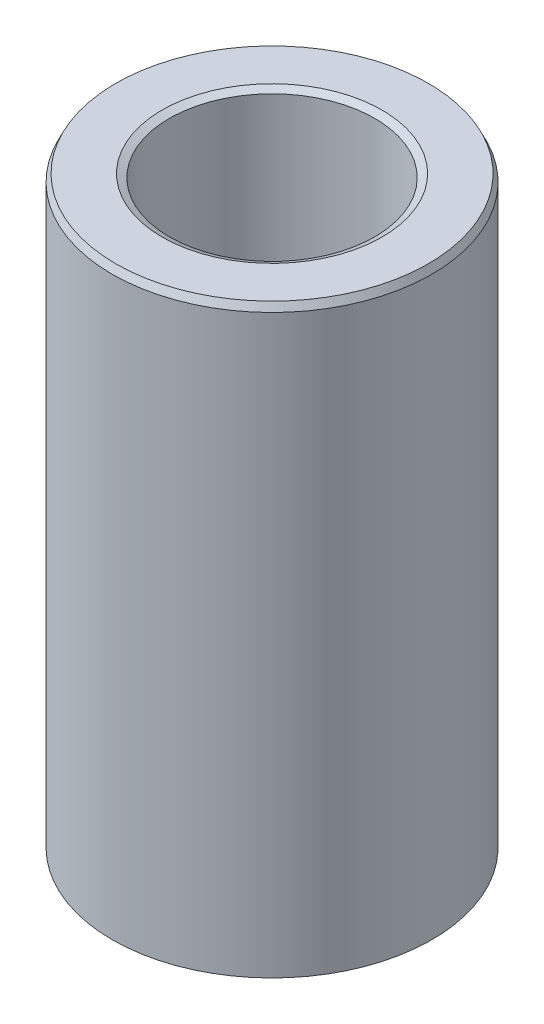
ISO-10303-21;
HEADER;
FILE_DESCRIPTION(('STEP AP214'),'2;1');
FILE_NAME('part.step','',(''),(''),'','','');
FILE_SCHEMA(('AUTOMOTIVE_DESIGN { 1 0 10303 214 1 1 1 1 }'));
ENDSEC;
DATA;
#1=APPLICATION_CONTEXT('core data for automotive mechanical design processes');
#2=APPLICATION_PROTOCOL_DEFINITION('international standard','automotive_design',2000,#1);
#3=PRODUCT_CONTEXT('',#1,'mechanical');
#4=PRODUCT('Part','Part','',(#3));
#5=PRODUCT_RELATED_PRODUCT_CATEGORY('part','',(#4));
#6=PRODUCT_DEFINITION_FORMATION('','',#4);
#7=PRODUCT_DEFINITION_CONTEXT('part definition',#1,'design');
#8=PRODUCT_DEFINITION('design','',#6,#7);
#9=PRODUCT_DEFINITION_SHAPE('','',#8);
#10=(LENGTH_UNIT() NAMED_UNIT(*) SI_UNIT(.MILLI.,.METRE.));
#11=(NAMED_UNIT(*) PLANE_ANGLE_UNIT() SI_UNIT($,.RADIAN.));
#12=(NAMED_UNIT(*) SI_UNIT($,.STERADIAN.) SOLID_ANGLE_UNIT());
#13=UNCERTAINTY_MEASURE_WITH_UNIT(LENGTH_MEASURE(1.E-05),#10,'distance_accuracy_value','');
#14=(GEOMETRIC_REPRESENTATION_CONTEXT(3) GLOBAL_UNCERTAINTY_ASSIGNED_CONTEXT((#13)) GLOBAL_UNIT_ASSIGNED_CONTEXT((#10,
#11,#12)) REPRESENTATION_CONTEXT('',''));
#15=CARTESIAN_POINT('',(0.,0.,0.));
#16=DIRECTION('',(0.,0.,1.));
#17=DIRECTION('',(1.,0.,0.));
#18=AXIS2_PLACEMENT_3D('',#15,#16,#17);
#19=CARTESIAN_POINT('',(0.,192.904847847091,0.));
#20=DIRECTION('',(0.,-1.,0.));
#21=DIRECTION('',(0.,0.,-1.));
#22=AXIS2_PLACEMENT_3D('',#19,#20,#21);
#23=CYLINDRICAL_SURFACE('',#22,52.5);
#24=CARTESIAN_POINT('',(0.,1.15369242430183,0.));
#25=DIRECTION('',(0.,1.,0.));
#26=DIRECTION('',(0.,0.,1.));
#27=AXIS2_PLACEMENT_3D('',#24,#25,#26);
#28=CIRCLE('',#27,52.5);
#29=CARTESIAN_POINT('',(0.,1.15369242430183,52.5));
#30=VERTEX_POINT('',#29);
#31=EDGE_CURVE('E10',#30,#30,#28,.T.);
#32=ORIENTED_EDGE('',*,*,#31,.T.);
#33=EDGE_LOOP('',(#32));
#34=FACE_BOUND('',#33,.T.);
#35=CARTESIAN_POINT('',(0.,190.494336374024,0.));
#36=DIRECTION('',(0.,1.,0.));
#37=DIRECTION('',(0.,0.,1.));
#38=AXIS2_PLACEMENT_3D('',#35,#36,#37);
#39=CIRCLE('',#38,52.5);
#40=CARTESIAN_POINT('',(0.,190.494336374024,52.5));
#41=VERTEX_POINT('',#40);
#42=EDGE_CURVE('E50',#41,#41,#39,.F.);
#43=ORIENTED_EDGE('',*,*,#42,.T.);
#44=EDGE_LOOP('',(#43));
#45=FACE_BOUND('',#44,.T.);
#46=ADVANCED_FACE('F39',(#34,#45),#23,.T.);
#47=CARTESIAN_POINT('',(0.,192.904847847091,0.));
#48=DIRECTION('',(0.,1.,0.));
#49=DIRECTION('',(0.,0.,1.));
#50=AXIS2_PLACEMENT_3D('',#47,#48,#49);
#51=PLANE('',#50);
#52=CARTESIAN_POINT('',(0.,192.904847847091,0.));
#53=DIRECTION('',(0.,1.,0.));
#54=DIRECTION('',(0.,0.,1.));
#55=AXIS2_PLACEMENT_3D('',#52,#53,#54);
#56=CIRCLE('',#55,36.1433432827851);
#57=CARTESIAN_POINT('',(0.,192.904847847091,36.1433432827851));
#58=VERTEX_POINT('',#57);
#59=EDGE_CURVE('E58',#58,#58,#56,.F.);
#60=ORIENTED_EDGE('',*,*,#59,.T.);
#61=EDGE_LOOP('',(#60));
#62=FACE_BOUND('',#61,.T.);
#63=CARTESIAN_POINT('',(0.,192.904847847091,0.));
#64=DIRECTION('',(0.,1.,0.));
#65=DIRECTION('',(0.,0.,1.));
#66=AXIS2_PLACEMENT_3D('',#63,#64,#65);
#67=CIRCLE('',#66,51.3463075756982);
#68=CARTESIAN_POINT('',(0.,192.904847847091,51.3463075756982));
#69=VERTEX_POINT('',#68);
#70=EDGE_CURVE('E61',#69,#69,#67,.T.);
#71=ORIENTED_EDGE('',*,*,#70,.T.);
#72=EDGE_LOOP('',(#71));
#73=FACE_BOUND('',#72,.T.);
#74=ADVANCED_FACE('F88',(#62,#73),#51,.T.);
#75=CARTESIAN_POINT('',(0.,0.,0.));
#76=DIRECTION('',(0.,1.,0.));
#77=DIRECTION('',(0.,0.,1.));
#78=AXIS2_PLACEMENT_3D('',#75,#76,#77);
#79=PLANE('',#78);
#80=CARTESIAN_POINT('',(0.,0.,0.));
#81=DIRECTION('',(0.,1.,0.));
#82=DIRECTION('',(0.,0.,1.));
#83=AXIS2_PLACEMENT_3D('',#80,#81,#82);
#84=CIRCLE('',#83,34.8865242340193);
#85=CARTESIAN_POINT('',(0.,0.,34.8865242340193));
#86=VERTEX_POINT('',#85);
#87=EDGE_CURVE('E51',#86,#86,#84,.T.);
#88=ORIENTED_EDGE('',*,*,#87,.T.);
#89=EDGE_LOOP('',(#88));
#90=FACE_BOUND('',#89,.T.);
#91=CARTESIAN_POINT('',(0.,0.,0.));
#92=DIRECTION('',(0.,1.,0.));
#93=DIRECTION('',(0.,0.,1.));
#94=AXIS2_PLACEMENT_3D('',#91,#92,#93);
#95=CIRCLE('',#94,50.0894885269323);
#96=CARTESIAN_POINT('',(0.,0.,50.0894885269323));
#97=VERTEX_POINT('',#96);
#98=EDGE_CURVE('E54',#97,#97,#95,.F.);
#99=ORIENTED_EDGE('',*,*,#98,.T.);
#100=EDGE_LOOP('',(#99));
#101=FACE_BOUND('',#100,.T.);
#102=ADVANCED_FACE('F83',(#90,#101),#79,.F.);
#103=CARTESIAN_POINT('',(0.,192.904847847091,0.));
#104=DIRECTION('',(0.,-1.,0.));
#105=DIRECTION('',(0.,0.,-1.));
#106=AXIS2_PLACEMENT_3D('',#103,#104,#105);
#107=CYLINDRICAL_SURFACE('',#106,33.7328318097175);
#108=CARTESIAN_POINT('',(0.,191.75115542279,0.));
#109=DIRECTION('',(0.,1.,0.));
#110=DIRECTION('',(0.,0.,1.));
#111=AXIS2_PLACEMENT_3D('',#108,#109,#110);
#112=CIRCLE('',#111,33.7328318097175);
#113=CARTESIAN_POINT('',(0.,191.75115542279,33.7328318097175));
#114=VERTEX_POINT('',#113);
#115=EDGE_CURVE('E67',#114,#114,#112,.T.);
#116=ORIENTED_EDGE('',*,*,#115,.T.);
#117=EDGE_LOOP('',(#116));
#118=FACE_BOUND('',#117,.T.);
#119=CARTESIAN_POINT('',(0.,2.41051147306767,0.));
#120=DIRECTION('',(0.,1.,0.));
#121=DIRECTION('',(0.,0.,1.));
#122=AXIS2_PLACEMENT_3D('',#119,#120,#121);
#123=CIRCLE('',#122,33.7328318097175);
#124=CARTESIAN_POINT('',(0.,2.41051147306767,33.7328318097175));
#125=VERTEX_POINT('',#124);
#126=EDGE_CURVE('E69',#125,#125,#123,.F.);
#127=ORIENTED_EDGE('',*,*,#126,.T.);
#128=EDGE_LOOP('',(#127));
#129=FACE_BOUND('',#128,.T.);
#130=ADVANCED_FACE('F71',(#118,#129),#107,.F.);
#131=CARTESIAN_POINT('',(0.,191.75115542279,0.));
#132=DIRECTION('',(0.,1.,0.));
#133=DIRECTION('',(0.,0.,1.));
#134=AXIS2_PLACEMENT_3D('',#131,#132,#133);
#135=CONICAL_SURFACE('',#134,33.7328318097175,1.1244075123245);
#136=ORIENTED_EDGE('',*,*,#59,.F.);
#137=EDGE_LOOP('',(#136));
#138=FACE_BOUND('',#137,.T.);
#139=ORIENTED_EDGE('',*,*,#115,.F.);
#140=EDGE_LOOP('',(#139));
#141=FACE_BOUND('',#140,.T.);
#142=ADVANCED_FACE('F77',(#138,#141),#135,.F.);
#143=CARTESIAN_POINT('',(0.,0.,0.));
#144=DIRECTION('',(0.,-1.,0.));
#145=DIRECTION('',(0.,0.,-1.));
#146=AXIS2_PLACEMENT_3D('',#143,#144,#145);
#147=CONICAL_SURFACE('',#146,34.8865242340193,0.446388814470393);
#148=ORIENTED_EDGE('',*,*,#126,.F.);
#149=EDGE_LOOP('',(#148));
#150=FACE_BOUND('',#149,.T.);
#151=ORIENTED_EDGE('',*,*,#87,.F.);
#152=EDGE_LOOP('',(#151));
#153=FACE_BOUND('',#152,.T.);
#154=ADVANCED_FACE('F73',(#150,#153),#147,.F.);
#155=CARTESIAN_POINT('',(0.,1.15369242430183,0.));
#156=DIRECTION('',(0.,1.,0.));
#157=DIRECTION('',(0.,0.,1.));
#158=AXIS2_PLACEMENT_3D('',#155,#156,#157);
#159=CONICAL_SURFACE('',#158,52.5,1.1244075123245);
#160=ORIENTED_EDGE('',*,*,#98,.F.);
#161=EDGE_LOOP('',(#160));
#162=FACE_BOUND('',#161,.T.);
#163=ORIENTED_EDGE('',*,*,#31,.F.);
#164=EDGE_LOOP('',(#163));
#165=FACE_BOUND('',#164,.T.);
#166=ADVANCED_FACE('F76',(#162,#165),#159,.T.);
#167=CARTESIAN_POINT('',(0.,192.904847847091,0.));
#168=DIRECTION('',(0.,-1.,0.));
#169=DIRECTION('',(0.,0.,-1.));
#170=AXIS2_PLACEMENT_3D('',#167,#168,#169);
#171=CONICAL_SURFACE('',#170,51.3463075756982,0.446388814470393);
#172=ORIENTED_EDGE('',*,*,#42,.F.);
#173=EDGE_LOOP('',(#172));
#174=FACE_BOUND('',#173,.T.);
#175=ORIENTED_EDGE('',*,*,#70,.F.);
#176=EDGE_LOOP('',(#175));
#177=FACE_BOUND('',#176,.T.);
#178=ADVANCED_FACE('F45',(#174,#177),#171,.T.);
#179=CLOSED_SHELL('',(#46,#74,#102,#130,#142,#154,#166,#178));
#180=MANIFOLD_SOLID_BREP('B2',#179);
#181=ADVANCED_BREP_SHAPE_REPRESENTATION('',(#18,#180),#14);
#182=SHAPE_DEFINITION_REPRESENTATION(#9,#181);
ENDSEC;
END-ISO-10303-21;
